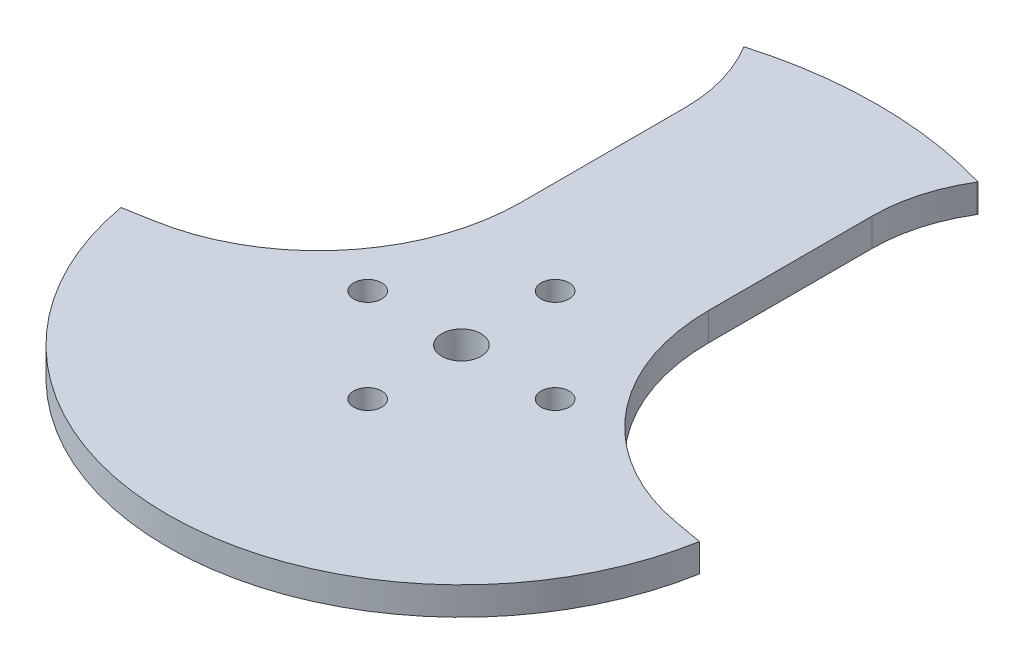
ISO-10303-21;
HEADER;
FILE_DESCRIPTION(('STEP AP214'),'2;1');
FILE_NAME('part.step','',(''),(''),'','','');
FILE_SCHEMA(('AUTOMOTIVE_DESIGN { 1 0 10303 214 1 1 1 1 }'));
ENDSEC;
DATA;
#1=APPLICATION_CONTEXT('core data for automotive mechanical design processes');
#2=APPLICATION_PROTOCOL_DEFINITION('international standard','automotive_design',2000,#1);
#3=PRODUCT_CONTEXT('',#1,'mechanical');
#4=PRODUCT('Part','Part','',(#3));
#5=PRODUCT_RELATED_PRODUCT_CATEGORY('part','',(#4));
#6=PRODUCT_DEFINITION_FORMATION('','',#4);
#7=PRODUCT_DEFINITION_CONTEXT('part definition',#1,'design');
#8=PRODUCT_DEFINITION('design','',#6,#7);
#9=PRODUCT_DEFINITION_SHAPE('','',#8);
#10=(LENGTH_UNIT() NAMED_UNIT(*) SI_UNIT(.MILLI.,.METRE.));
#11=(NAMED_UNIT(*) PLANE_ANGLE_UNIT() SI_UNIT($,.RADIAN.));
#12=(NAMED_UNIT(*) SI_UNIT($,.STERADIAN.) SOLID_ANGLE_UNIT());
#13=UNCERTAINTY_MEASURE_WITH_UNIT(LENGTH_MEASURE(1.E-05),#10,'distance_accuracy_value','');
#14=(GEOMETRIC_REPRESENTATION_CONTEXT(3) GLOBAL_UNCERTAINTY_ASSIGNED_CONTEXT((#13)) GLOBAL_UNIT_ASSIGNED_CONTEXT((#10,
#11,#12)) REPRESENTATION_CONTEXT('',''));
#15=CARTESIAN_POINT('',(0.,0.,0.));
#16=DIRECTION('',(0.,0.,1.));
#17=DIRECTION('',(1.,0.,0.));
#18=AXIS2_PLACEMENT_3D('',#15,#16,#17);
#19=CARTESIAN_POINT('',(0.,3.,1.73472347597681E-13));
#20=DIRECTION('',(0.,-1.,0.));
#21=DIRECTION('',(0.,0.,-1.));
#22=AXIS2_PLACEMENT_3D('',#19,#20,#21);
#23=CYLINDRICAL_SURFACE('',#22,44.4500000000002);
#24=CARTESIAN_POINT('',(0.,0.,1.73472347597681E-13));
#25=DIRECTION('',(0.,1.,0.));
#26=DIRECTION('',(0.,0.,-1.));
#27=AXIS2_PLACEMENT_3D('',#24,#25,#26);
#28=CIRCLE('',#27,44.4500000000002);
#29=CARTESIAN_POINT('',(12.5,0.,-42.6562129120718));
#30=VERTEX_POINT('',#29);
#31=CARTESIAN_POINT('',(-12.5,0.,-42.6562129120718));
#32=VERTEX_POINT('',#31);
#33=EDGE_CURVE('E164',#30,#32,#28,.T.);
#34=ORIENTED_EDGE('',*,*,#33,.T.);
#35=DIRECTION('',(0.,-1.,0.));
#36=VECTOR('',#35,1.);
#37=CARTESIAN_POINT('',(-12.5,3.,-42.6562129120718));
#38=LINE('',#37,#36);
#39=CARTESIAN_POINT('',(-12.5,3.,-42.6562129120718));
#40=VERTEX_POINT('',#39);
#41=EDGE_CURVE('E11',#40,#32,#38,.T.);
#42=ORIENTED_EDGE('',*,*,#41,.F.);
#43=CARTESIAN_POINT('',(0.,3.,1.73472347597681E-13));
#44=DIRECTION('',(0.,1.,0.));
#45=DIRECTION('',(0.,0.,-1.));
#46=AXIS2_PLACEMENT_3D('',#43,#44,#45);
#47=CIRCLE('',#46,44.4500000000002);
#48=CARTESIAN_POINT('',(12.5,3.,-42.6562129120718));
#49=VERTEX_POINT('',#48);
#50=EDGE_CURVE('E199',#49,#40,#47,.T.);
#51=ORIENTED_EDGE('',*,*,#50,.F.);
#52=DIRECTION('',(0.,-1.,0.));
#53=VECTOR('',#52,1.);
#54=CARTESIAN_POINT('',(12.5,3.,-42.6562129120718));
#55=LINE('',#54,#53);
#56=EDGE_CURVE('E160',#49,#30,#55,.T.);
#57=ORIENTED_EDGE('',*,*,#56,.T.);
#58=EDGE_LOOP('',(#34,#42,#51,#57));
#59=FACE_BOUND('',#58,.T.);
#60=ADVANCED_FACE('F39',(#59),#23,.T.);
#61=CARTESIAN_POINT('',(-12.5,3.,-42.6562129120718));
#62=DIRECTION('',(0.854161971646219,0.,-0.520007044369058));
#63=DIRECTION('',(-0.520007044369058,0.,-0.854161971646219));
#64=AXIS2_PLACEMENT_3D('',#61,#62,#63);
#65=PLANE('',#64);
#66=DIRECTION('',(0.520007044369058,0.,0.854161971646219));
#67=VECTOR('',#66,1.);
#68=CARTESIAN_POINT('',(-12.5,0.,-42.6562129120718));
#69=LINE('',#68,#67);
#70=CARTESIAN_POINT('',(-12.4479992955631,0.,-42.5707967149072));
#71=VERTEX_POINT('',#70);
#72=EDGE_CURVE('E168',#32,#71,#69,.T.);
#73=ORIENTED_EDGE('',*,*,#72,.T.);
#74=DIRECTION('',(0.,-1.,0.));
#75=VECTOR('',#74,1.);
#76=CARTESIAN_POINT('',(-12.4479992955631,3.,-42.5707967149072));
#77=LINE('',#76,#75);
#78=CARTESIAN_POINT('',(-12.4479992955631,3.,-42.5707967149072));
#79=VERTEX_POINT('',#78);
#80=EDGE_CURVE('E48',#79,#71,#77,.T.);
#81=ORIENTED_EDGE('',*,*,#80,.F.);
#82=DIRECTION('',(0.520007044369058,0.,0.854161971646219));
#83=VECTOR('',#82,1.);
#84=CARTESIAN_POINT('',(-12.5,3.,-42.6562129120718));
#85=LINE('',#84,#83);
#86=EDGE_CURVE('E111',#40,#79,#85,.T.);
#87=ORIENTED_EDGE('',*,*,#86,.F.);
#88=ORIENTED_EDGE('',*,*,#41,.T.);
#89=EDGE_LOOP('',(#73,#81,#87,#88));
#90=FACE_BOUND('',#89,.T.);
#91=ADVANCED_FACE('F294',(#90),#65,.F.);
#92=CARTESIAN_POINT('',(-26.7857404765812,3.,-33.8420934221337));
#93=DIRECTION('',(0.,-1.,0.));
#94=DIRECTION('',(0.,0.,-1.));
#95=AXIS2_PLACEMENT_3D('',#92,#93,#94);
#96=CYLINDRICAL_SURFACE('',#95,16.7857404765812);
#97=CARTESIAN_POINT('',(-26.7857404765812,0.,-33.8420934221337));
#98=DIRECTION('',(0.,-1.,0.));
#99=DIRECTION('',(0.,0.,-1.));
#100=AXIS2_PLACEMENT_3D('',#97,#98,#99);
#101=CIRCLE('',#100,16.7857404765812);
#102=CARTESIAN_POINT('',(-10.,0.,-33.8420934221337));
#103=VERTEX_POINT('',#102);
#104=EDGE_CURVE('E172',#71,#103,#101,.T.);
#105=ORIENTED_EDGE('',*,*,#104,.T.);
#106=DIRECTION('',(0.,-1.,0.));
#107=VECTOR('',#106,1.);
#108=CARTESIAN_POINT('',(-10.,3.,-33.8420934221337));
#109=LINE('',#108,#107);
#110=CARTESIAN_POINT('',(-10.,3.,-33.8420934221337));
#111=VERTEX_POINT('',#110);
#112=EDGE_CURVE('E226',#111,#103,#109,.T.);
#113=ORIENTED_EDGE('',*,*,#112,.F.);
#114=CARTESIAN_POINT('',(-26.7857404765812,3.,-33.8420934221337));
#115=DIRECTION('',(0.,-1.,0.));
#116=DIRECTION('',(0.,0.,-1.));
#117=AXIS2_PLACEMENT_3D('',#114,#115,#116);
#118=CIRCLE('',#117,16.7857404765812);
#119=EDGE_CURVE('E236',#79,#111,#118,.T.);
#120=ORIENTED_EDGE('',*,*,#119,.F.);
#121=ORIENTED_EDGE('',*,*,#80,.T.);
#122=EDGE_LOOP('',(#105,#113,#120,#121));
#123=FACE_BOUND('',#122,.T.);
#124=ADVANCED_FACE('F234',(#123),#96,.F.);
#125=CARTESIAN_POINT('',(-10.,3.,-33.8420934221337));
#126=DIRECTION('',(1.,0.,0.));
#127=DIRECTION('',(0.,0.,-1.));
#128=AXIS2_PLACEMENT_3D('',#125,#126,#127);
#129=PLANE('',#128);
#130=DIRECTION('',(0.,0.,1.));
#131=VECTOR('',#130,1.);
#132=CARTESIAN_POINT('',(-10.,0.,-33.8420934221337));
#133=LINE('',#132,#131);
#134=CARTESIAN_POINT('',(-9.99999999999999,0.,-16.4089854674819));
#135=VERTEX_POINT('',#134);
#136=EDGE_CURVE('E175',#103,#135,#133,.T.);
#137=ORIENTED_EDGE('',*,*,#136,.T.);
#138=DIRECTION('',(0.,-1.,0.));
#139=VECTOR('',#138,1.);
#140=CARTESIAN_POINT('',(-9.99999999999999,3.,-16.4089854674819));
#141=LINE('',#140,#139);
#142=CARTESIAN_POINT('',(-9.99999999999999,3.,-16.4089854674819));
#143=VERTEX_POINT('',#142);
#144=EDGE_CURVE('E222',#143,#135,#141,.T.);
#145=ORIENTED_EDGE('',*,*,#144,.F.);
#146=DIRECTION('',(0.,0.,1.));
#147=VECTOR('',#146,1.);
#148=CARTESIAN_POINT('',(-10.,3.,-33.8420934221337));
#149=LINE('',#148,#147);
#150=EDGE_CURVE('E255',#111,#143,#149,.T.);
#151=ORIENTED_EDGE('',*,*,#150,.F.);
#152=ORIENTED_EDGE('',*,*,#112,.T.);
#153=EDGE_LOOP('',(#137,#145,#151,#152));
#154=FACE_BOUND('',#153,.T.);
#155=ADVANCED_FACE('F245',(#154),#129,.F.);
#156=CARTESIAN_POINT('',(-31.6568505090039,3.,-16.4089854674819));
#157=DIRECTION('',(0.,-1.,0.));
#158=DIRECTION('',(0.,0.,-1.));
#159=AXIS2_PLACEMENT_3D('',#156,#157,#158);
#160=CYLINDRICAL_SURFACE('',#159,21.6568505090039);
#161=CARTESIAN_POINT('',(-31.6568505090039,0.,-16.4089854674819));
#162=DIRECTION('',(0.,-1.,0.));
#163=DIRECTION('',(0.,0.,-1.));
#164=AXIS2_PLACEMENT_3D('',#161,#162,#163);
#165=CIRCLE('',#164,21.6568505090039);
#166=CARTESIAN_POINT('',(-27.8961778841101,0.,4.91884881961152));
#167=VERTEX_POINT('',#166);
#168=EDGE_CURVE('E178',#135,#167,#165,.T.);
#169=ORIENTED_EDGE('',*,*,#168,.T.);
#170=DIRECTION('',(0.,-1.,0.));
#171=VECTOR('',#170,1.);
#172=CARTESIAN_POINT('',(-27.8961778841101,3.,4.91884881961152));
#173=LINE('',#172,#171);
#174=CARTESIAN_POINT('',(-27.8961778841101,3.,4.91884881961152));
#175=VERTEX_POINT('',#174);
#176=EDGE_CURVE('E218',#175,#167,#173,.T.);
#177=ORIENTED_EDGE('',*,*,#176,.F.);
#178=CARTESIAN_POINT('',(-31.6568505090039,3.,-16.4089854674819));
#179=DIRECTION('',(0.,-1.,0.));
#180=DIRECTION('',(0.,0.,-1.));
#181=AXIS2_PLACEMENT_3D('',#178,#179,#180);
#182=CIRCLE('',#181,21.6568505090039);
#183=EDGE_CURVE('E251',#143,#175,#182,.T.);
#184=ORIENTED_EDGE('',*,*,#183,.F.);
#185=ORIENTED_EDGE('',*,*,#144,.T.);
#186=EDGE_LOOP('',(#169,#177,#184,#185));
#187=FACE_BOUND('',#186,.T.);
#188=ADVANCED_FACE('F249',(#187),#160,.F.);
#189=CARTESIAN_POINT('',(-27.8961778841101,3.,4.91884881961152));
#190=DIRECTION('',(0.173648177666934,0.,0.984807753012207));
#191=DIRECTION('',(0.984807753012208,0.,-0.173648177666934));
#192=AXIS2_PLACEMENT_3D('',#189,#190,#191);
#193=PLANE('',#192);
#194=DIRECTION('',(-0.984807753012207,0.,0.173648177666934));
#195=VECTOR('',#194,1.);
#196=CARTESIAN_POINT('',(-27.8961778841101,0.,4.91884881961152));
#197=LINE('',#196,#195);
#198=CARTESIAN_POINT('',(-30.8737230569327,0.,5.4438703698584));
#199=VERTEX_POINT('',#198);
#200=EDGE_CURVE('E181',#167,#199,#197,.T.);
#201=ORIENTED_EDGE('',*,*,#200,.T.);
#202=DIRECTION('',(0.,-1.,0.));
#203=VECTOR('',#202,1.);
#204=CARTESIAN_POINT('',(-30.8737230569327,3.,5.4438703698584));
#205=LINE('',#204,#203);
#206=CARTESIAN_POINT('',(-30.8737230569327,3.,5.4438703698584));
#207=VERTEX_POINT('',#206);
#208=EDGE_CURVE('E214',#207,#199,#205,.T.);
#209=ORIENTED_EDGE('',*,*,#208,.F.);
#210=DIRECTION('',(-0.984807753012207,0.,0.173648177666934));
#211=VECTOR('',#210,1.);
#212=CARTESIAN_POINT('',(-27.8961778841101,3.,4.91884881961152));
#213=LINE('',#212,#211);
#214=EDGE_CURVE('E254',#175,#207,#213,.T.);
#215=ORIENTED_EDGE('',*,*,#214,.F.);
#216=ORIENTED_EDGE('',*,*,#176,.T.);
#217=EDGE_LOOP('',(#201,#209,#215,#216));
#218=FACE_BOUND('',#217,.T.);
#219=ADVANCED_FACE('F307',(#218),#193,.F.);
#220=CARTESIAN_POINT('',(0.,3.,0.));
#221=DIRECTION('',(0.,-1.,0.));
#222=DIRECTION('',(0.,0.,-1.));
#223=AXIS2_PLACEMENT_3D('',#220,#221,#222);
#224=CYLINDRICAL_SURFACE('',#223,31.35);
#225=CARTESIAN_POINT('',(0.,0.,0.));
#226=DIRECTION('',(0.,1.,0.));
#227=DIRECTION('',(0.,0.,1.));
#228=AXIS2_PLACEMENT_3D('',#225,#226,#227);
#229=CIRCLE('',#228,31.35);
#230=CARTESIAN_POINT('',(30.8737230569327,0.,5.4438703698584));
#231=VERTEX_POINT('',#230);
#232=EDGE_CURVE('E184',#199,#231,#229,.T.);
#233=ORIENTED_EDGE('',*,*,#232,.T.);
#234=DIRECTION('',(0.,-1.,0.));
#235=VECTOR('',#234,1.);
#236=CARTESIAN_POINT('',(30.8737230569327,3.,5.4438703698584));
#237=LINE('',#236,#235);
#238=CARTESIAN_POINT('',(30.8737230569327,3.,5.4438703698584));
#239=VERTEX_POINT('',#238);
#240=EDGE_CURVE('E210',#239,#231,#237,.T.);
#241=ORIENTED_EDGE('',*,*,#240,.F.);
#242=CARTESIAN_POINT('',(0.,3.,0.));
#243=DIRECTION('',(0.,1.,0.));
#244=DIRECTION('',(0.,0.,1.));
#245=AXIS2_PLACEMENT_3D('',#242,#243,#244);
#246=CIRCLE('',#245,31.35);
#247=EDGE_CURVE('E259',#207,#239,#246,.T.);
#248=ORIENTED_EDGE('',*,*,#247,.F.);
#249=ORIENTED_EDGE('',*,*,#208,.T.);
#250=EDGE_LOOP('',(#233,#241,#248,#249));
#251=FACE_BOUND('',#250,.T.);
#252=ADVANCED_FACE('F310',(#251),#224,.T.);
#253=CARTESIAN_POINT('',(27.8961778841101,3.,4.91884881961152));
#254=DIRECTION('',(-0.173648177666935,0.,0.984807753012207));
#255=DIRECTION('',(0.984807753012207,0.,0.173648177666935));
#256=AXIS2_PLACEMENT_3D('',#253,#254,#255);
#257=PLANE('',#256);
#258=DIRECTION('',(-0.984807753012207,0.,-0.173648177666935));
#259=VECTOR('',#258,1.);
#260=CARTESIAN_POINT('',(27.8961778841101,0.,4.91884881961152));
#261=LINE('',#260,#259);
#262=CARTESIAN_POINT('',(27.8961778841101,0.,4.91884881961152));
#263=VERTEX_POINT('',#262);
#264=EDGE_CURVE('E187',#231,#263,#261,.T.);
#265=ORIENTED_EDGE('',*,*,#264,.T.);
#266=DIRECTION('',(0.,-1.,0.));
#267=VECTOR('',#266,1.);
#268=CARTESIAN_POINT('',(27.8961778841101,3.,4.91884881961152));
#269=LINE('',#268,#267);
#270=CARTESIAN_POINT('',(27.8961778841101,3.,4.91884881961152));
#271=VERTEX_POINT('',#270);
#272=EDGE_CURVE('E206',#271,#263,#269,.T.);
#273=ORIENTED_EDGE('',*,*,#272,.F.);
#274=DIRECTION('',(-0.984807753012207,0.,-0.173648177666935));
#275=VECTOR('',#274,1.);
#276=CARTESIAN_POINT('',(27.8961778841101,3.,4.91884881961152));
#277=LINE('',#276,#275);
#278=EDGE_CURVE('E266',#239,#271,#277,.T.);
#279=ORIENTED_EDGE('',*,*,#278,.F.);
#280=ORIENTED_EDGE('',*,*,#240,.T.);
#281=EDGE_LOOP('',(#265,#273,#279,#280));
#282=FACE_BOUND('',#281,.T.);
#283=ADVANCED_FACE('F274',(#282),#257,.F.);
#284=CARTESIAN_POINT('',(31.6568505090039,3.,-16.4089854674819));
#285=DIRECTION('',(0.,-1.,0.));
#286=DIRECTION('',(0.,0.,-1.));
#287=AXIS2_PLACEMENT_3D('',#284,#285,#286);
#288=CYLINDRICAL_SURFACE('',#287,21.6568505090039);
#289=CARTESIAN_POINT('',(31.6568505090039,0.,-16.4089854674819));
#290=DIRECTION('',(0.,-1.,0.));
#291=DIRECTION('',(0.,0.,1.));
#292=AXIS2_PLACEMENT_3D('',#289,#290,#291);
#293=CIRCLE('',#292,21.6568505090039);
#294=CARTESIAN_POINT('',(9.99999999999999,0.,-16.4089854674819));
#295=VERTEX_POINT('',#294);
#296=EDGE_CURVE('E190',#263,#295,#293,.T.);
#297=ORIENTED_EDGE('',*,*,#296,.T.);
#298=DIRECTION('',(0.,-1.,0.));
#299=VECTOR('',#298,1.);
#300=CARTESIAN_POINT('',(9.99999999999999,3.,-16.4089854674819));
#301=LINE('',#300,#299);
#302=CARTESIAN_POINT('',(9.99999999999999,3.,-16.4089854674819));
#303=VERTEX_POINT('',#302);
#304=EDGE_CURVE('E153',#303,#295,#301,.T.);
#305=ORIENTED_EDGE('',*,*,#304,.F.);
#306=CARTESIAN_POINT('',(31.6568505090039,3.,-16.4089854674819));
#307=DIRECTION('',(0.,-1.,0.));
#308=DIRECTION('',(0.,0.,1.));
#309=AXIS2_PLACEMENT_3D('',#306,#307,#308);
#310=CIRCLE('',#309,21.6568505090039);
#311=EDGE_CURVE('E142',#271,#303,#310,.T.);
#312=ORIENTED_EDGE('',*,*,#311,.F.);
#313=ORIENTED_EDGE('',*,*,#272,.T.);
#314=EDGE_LOOP('',(#297,#305,#312,#313));
#315=FACE_BOUND('',#314,.T.);
#316=ADVANCED_FACE('F278',(#315),#288,.F.);
#317=CARTESIAN_POINT('',(10.,3.,-33.8420934221337));
#318=DIRECTION('',(-1.,0.,0.));
#319=DIRECTION('',(0.,0.,1.));
#320=AXIS2_PLACEMENT_3D('',#317,#318,#319);
#321=PLANE('',#320);
#322=DIRECTION('',(0.,0.,-1.));
#323=VECTOR('',#322,1.);
#324=CARTESIAN_POINT('',(10.,0.,-33.8420934221337));
#325=LINE('',#324,#323);
#326=CARTESIAN_POINT('',(10.,0.,-33.8420934221337));
#327=VERTEX_POINT('',#326);
#328=EDGE_CURVE('E151',#295,#327,#325,.T.);
#329=ORIENTED_EDGE('',*,*,#328,.T.);
#330=DIRECTION('',(0.,-1.,0.));
#331=VECTOR('',#330,1.);
#332=CARTESIAN_POINT('',(10.,3.,-33.8420934221337));
#333=LINE('',#332,#331);
#334=CARTESIAN_POINT('',(10.,3.,-33.8420934221337));
#335=VERTEX_POINT('',#334);
#336=EDGE_CURVE('E148',#335,#327,#333,.T.);
#337=ORIENTED_EDGE('',*,*,#336,.F.);
#338=DIRECTION('',(0.,0.,-1.));
#339=VECTOR('',#338,1.);
#340=CARTESIAN_POINT('',(10.,3.,-33.8420934221337));
#341=LINE('',#340,#339);
#342=EDGE_CURVE('E136',#303,#335,#341,.T.);
#343=ORIENTED_EDGE('',*,*,#342,.F.);
#344=ORIENTED_EDGE('',*,*,#304,.T.);
#345=EDGE_LOOP('',(#329,#337,#343,#344));
#346=FACE_BOUND('',#345,.T.);
#347=ADVANCED_FACE('F149',(#346),#321,.F.);
#348=CARTESIAN_POINT('',(26.7857404765812,3.,-33.8420934221337));
#349=DIRECTION('',(0.,-1.,0.));
#350=DIRECTION('',(0.,0.,-1.));
#351=AXIS2_PLACEMENT_3D('',#348,#349,#350);
#352=CYLINDRICAL_SURFACE('',#351,16.7857404765812);
#353=CARTESIAN_POINT('',(26.7857404765812,0.,-33.8420934221337));
#354=DIRECTION('',(0.,-1.,0.));
#355=DIRECTION('',(0.,0.,1.));
#356=AXIS2_PLACEMENT_3D('',#353,#354,#355);
#357=CIRCLE('',#356,16.7857404765812);
#358=CARTESIAN_POINT('',(12.4479992955631,0.,-42.5707967149072));
#359=VERTEX_POINT('',#358);
#360=EDGE_CURVE('E97',#327,#359,#357,.T.);
#361=ORIENTED_EDGE('',*,*,#360,.T.);
#362=DIRECTION('',(0.,-1.,0.));
#363=VECTOR('',#362,1.);
#364=CARTESIAN_POINT('',(12.4479992955631,3.,-42.5707967149072));
#365=LINE('',#364,#363);
#366=CARTESIAN_POINT('',(12.4479992955631,3.,-42.5707967149072));
#367=VERTEX_POINT('',#366);
#368=EDGE_CURVE('E154',#367,#359,#365,.T.);
#369=ORIENTED_EDGE('',*,*,#368,.F.);
#370=CARTESIAN_POINT('',(26.7857404765812,3.,-33.8420934221337));
#371=DIRECTION('',(0.,-1.,0.));
#372=DIRECTION('',(0.,0.,1.));
#373=AXIS2_PLACEMENT_3D('',#370,#371,#372);
#374=CIRCLE('',#373,16.7857404765812);
#375=EDGE_CURVE('E140',#335,#367,#374,.T.);
#376=ORIENTED_EDGE('',*,*,#375,.F.);
#377=ORIENTED_EDGE('',*,*,#336,.T.);
#378=EDGE_LOOP('',(#361,#369,#376,#377));
#379=FACE_BOUND('',#378,.T.);
#380=ADVANCED_FACE('F156',(#379),#352,.F.);
#381=CARTESIAN_POINT('',(12.5,3.,-42.6562129120718));
#382=DIRECTION('',(-0.854161971646188,0.,-0.520007044369109));
#383=DIRECTION('',(-0.520007044369109,0.,0.854161971646188));
#384=AXIS2_PLACEMENT_3D('',#381,#382,#383);
#385=PLANE('',#384);
#386=DIRECTION('',(0.520007044369109,0.,-0.854161971646188));
#387=VECTOR('',#386,1.);
#388=CARTESIAN_POINT('',(12.5,0.,-42.6562129120718));
#389=LINE('',#388,#387);
#390=EDGE_CURVE('E103',#359,#30,#389,.T.);
#391=ORIENTED_EDGE('',*,*,#390,.T.);
#392=ORIENTED_EDGE('',*,*,#56,.F.);
#393=DIRECTION('',(0.520007044369109,0.,-0.854161971646188));
#394=VECTOR('',#393,1.);
#395=CARTESIAN_POINT('',(12.5,3.,-42.6562129120718));
#396=LINE('',#395,#394);
#397=EDGE_CURVE('E56',#367,#49,#396,.T.);
#398=ORIENTED_EDGE('',*,*,#397,.F.);
#399=ORIENTED_EDGE('',*,*,#368,.T.);
#400=EDGE_LOOP('',(#391,#392,#398,#399));
#401=FACE_BOUND('',#400,.T.);
#402=ADVANCED_FACE('F282',(#401),#385,.F.);
#403=CARTESIAN_POINT('',(0.,3.,1.73472347597681E-13));
#404=DIRECTION('',(0.,-1.,0.));
#405=DIRECTION('',(0.,0.,-1.));
#406=AXIS2_PLACEMENT_3D('',#403,#404,#405);
#407=PLANE('',#406);
#408=CARTESIAN_POINT('',(10.,3.,-0.0140875505962867));
#409=DIRECTION('',(0.,1.,0.));
#410=DIRECTION('',(0.,0.,1.));
#411=AXIS2_PLACEMENT_3D('',#408,#409,#410);
#412=CIRCLE('',#411,1.5);
#413=CARTESIAN_POINT('',(10.,3.,1.48591244940371));
#414=VERTEX_POINT('',#413);
#415=EDGE_CURVE('E406',#414,#414,#412,.T.);
#416=ORIENTED_EDGE('',*,*,#415,.F.);
#417=EDGE_LOOP('',(#416));
#418=FACE_BOUND('',#417,.T.);
#419=CARTESIAN_POINT('',(0.,3.,-10.0140875505963));
#420=DIRECTION('',(0.,1.,0.));
#421=DIRECTION('',(0.,0.,1.));
#422=AXIS2_PLACEMENT_3D('',#419,#420,#421);
#423=CIRCLE('',#422,1.5);
#424=CARTESIAN_POINT('',(0.,3.,-8.51408755059629));
#425=VERTEX_POINT('',#424);
#426=EDGE_CURVE('E415',#425,#425,#423,.T.);
#427=ORIENTED_EDGE('',*,*,#426,.F.);
#428=EDGE_LOOP('',(#427));
#429=FACE_BOUND('',#428,.T.);
#430=CARTESIAN_POINT('',(-10.,3.,-0.0140875505962867));
#431=DIRECTION('',(0.,1.,0.));
#432=DIRECTION('',(0.,0.,1.));
#433=AXIS2_PLACEMENT_3D('',#430,#431,#432);
#434=CIRCLE('',#433,1.5);
#435=CARTESIAN_POINT('',(-10.,3.,1.48591244940371));
#436=VERTEX_POINT('',#435);
#437=EDGE_CURVE('E442',#436,#436,#434,.T.);
#438=ORIENTED_EDGE('',*,*,#437,.F.);
#439=EDGE_LOOP('',(#438));
#440=FACE_BOUND('',#439,.T.);
#441=CARTESIAN_POINT('',(0.,3.,9.98591244940371));
#442=DIRECTION('',(0.,1.,0.));
#443=DIRECTION('',(0.,0.,1.));
#444=AXIS2_PLACEMENT_3D('',#441,#442,#443);
#445=CIRCLE('',#444,1.5);
#446=CARTESIAN_POINT('',(0.,3.,11.4859124494037));
#447=VERTEX_POINT('',#446);
#448=EDGE_CURVE('E453',#447,#447,#445,.T.);
#449=ORIENTED_EDGE('',*,*,#448,.F.);
#450=EDGE_LOOP('',(#449));
#451=FACE_BOUND('',#450,.T.);
#452=CARTESIAN_POINT('',(0.,3.,-0.0140875505962867));
#453=DIRECTION('',(0.,1.,0.));
#454=DIRECTION('',(0.,0.,1.));
#455=AXIS2_PLACEMENT_3D('',#452,#453,#454);
#456=CIRCLE('',#455,2.1);
#457=CARTESIAN_POINT('',(0.,3.,2.08591244940371));
#458=VERTEX_POINT('',#457);
#459=EDGE_CURVE('E412',#458,#458,#456,.T.);
#460=ORIENTED_EDGE('',*,*,#459,.F.);
#461=EDGE_LOOP('',(#460));
#462=FACE_BOUND('',#461,.T.);
#463=ORIENTED_EDGE('',*,*,#50,.T.);
#464=ORIENTED_EDGE('',*,*,#86,.T.);
#465=ORIENTED_EDGE('',*,*,#119,.T.);
#466=ORIENTED_EDGE('',*,*,#150,.T.);
#467=ORIENTED_EDGE('',*,*,#183,.T.);
#468=ORIENTED_EDGE('',*,*,#214,.T.);
#469=ORIENTED_EDGE('',*,*,#247,.T.);
#470=ORIENTED_EDGE('',*,*,#278,.T.);
#471=ORIENTED_EDGE('',*,*,#311,.T.);
#472=ORIENTED_EDGE('',*,*,#342,.T.);
#473=ORIENTED_EDGE('',*,*,#375,.T.);
#474=ORIENTED_EDGE('',*,*,#397,.T.);
#475=EDGE_LOOP('',(#463,#464,#465,#466,#467,#468,#469,#470,#471,#472,#473,#474));
#476=FACE_BOUND('',#475,.T.);
#477=ADVANCED_FACE('F138',(#418,#429,#440,#451,#462,#476),#407,.F.);
#478=CARTESIAN_POINT('',(0.,0.,1.73472347597681E-13));
#479=DIRECTION('',(0.,-1.,0.));
#480=DIRECTION('',(0.,0.,-1.));
#481=AXIS2_PLACEMENT_3D('',#478,#479,#480);
#482=PLANE('',#481);
#483=CARTESIAN_POINT('',(10.,0.,-0.0140875505962867));
#484=DIRECTION('',(0.,1.,0.));
#485=DIRECTION('',(0.,0.,1.));
#486=AXIS2_PLACEMENT_3D('',#483,#484,#485);
#487=CIRCLE('',#486,1.5);
#488=CARTESIAN_POINT('',(10.,0.,1.48591244940371));
#489=VERTEX_POINT('',#488);
#490=EDGE_CURVE('E403',#489,#489,#487,.T.);
#491=ORIENTED_EDGE('',*,*,#490,.T.);
#492=EDGE_LOOP('',(#491));
#493=FACE_BOUND('',#492,.T.);
#494=CARTESIAN_POINT('',(0.,0.,-10.0140875505963));
#495=DIRECTION('',(0.,1.,0.));
#496=DIRECTION('',(0.,0.,1.));
#497=AXIS2_PLACEMENT_3D('',#494,#495,#496);
#498=CIRCLE('',#497,1.5);
#499=CARTESIAN_POINT('',(0.,0.,-8.51408755059629));
#500=VERTEX_POINT('',#499);
#501=EDGE_CURVE('E408',#500,#500,#498,.T.);
#502=ORIENTED_EDGE('',*,*,#501,.T.);
#503=EDGE_LOOP('',(#502));
#504=FACE_BOUND('',#503,.T.);
#505=CARTESIAN_POINT('',(-10.,0.,-0.0140875505962867));
#506=DIRECTION('',(0.,1.,0.));
#507=DIRECTION('',(0.,0.,1.));
#508=AXIS2_PLACEMENT_3D('',#505,#506,#507);
#509=CIRCLE('',#508,1.5);
#510=CARTESIAN_POINT('',(-10.,0.,1.48591244940371));
#511=VERTEX_POINT('',#510);
#512=EDGE_CURVE('E422',#511,#511,#509,.T.);
#513=ORIENTED_EDGE('',*,*,#512,.T.);
#514=EDGE_LOOP('',(#513));
#515=FACE_BOUND('',#514,.T.);
#516=CARTESIAN_POINT('',(0.,0.,9.98591244940371));
#517=DIRECTION('',(0.,1.,0.));
#518=DIRECTION('',(0.,0.,1.));
#519=AXIS2_PLACEMENT_3D('',#516,#517,#518);
#520=CIRCLE('',#519,1.5);
#521=CARTESIAN_POINT('',(0.,0.,11.4859124494037));
#522=VERTEX_POINT('',#521);
#523=EDGE_CURVE('E448',#522,#522,#520,.T.);
#524=ORIENTED_EDGE('',*,*,#523,.T.);
#525=EDGE_LOOP('',(#524));
#526=FACE_BOUND('',#525,.T.);
#527=CARTESIAN_POINT('',(0.,0.,-0.0140875505962867));
#528=DIRECTION('',(0.,1.,0.));
#529=DIRECTION('',(0.,0.,1.));
#530=AXIS2_PLACEMENT_3D('',#527,#528,#529);
#531=CIRCLE('',#530,2.1);
#532=CARTESIAN_POINT('',(0.,0.,2.08591244940371));
#533=VERTEX_POINT('',#532);
#534=EDGE_CURVE('E169',#533,#533,#531,.T.);
#535=ORIENTED_EDGE('',*,*,#534,.T.);
#536=EDGE_LOOP('',(#535));
#537=FACE_BOUND('',#536,.T.);
#538=ORIENTED_EDGE('',*,*,#33,.F.);
#539=ORIENTED_EDGE('',*,*,#390,.F.);
#540=ORIENTED_EDGE('',*,*,#360,.F.);
#541=ORIENTED_EDGE('',*,*,#328,.F.);
#542=ORIENTED_EDGE('',*,*,#296,.F.);
#543=ORIENTED_EDGE('',*,*,#264,.F.);
#544=ORIENTED_EDGE('',*,*,#232,.F.);
#545=ORIENTED_EDGE('',*,*,#200,.F.);
#546=ORIENTED_EDGE('',*,*,#168,.F.);
#547=ORIENTED_EDGE('',*,*,#136,.F.);
#548=ORIENTED_EDGE('',*,*,#104,.F.);
#549=ORIENTED_EDGE('',*,*,#72,.F.);
#550=EDGE_LOOP('',(#538,#539,#540,#541,#542,#543,#544,#545,#546,#547,#548,#549));
#551=FACE_BOUND('',#550,.T.);
#552=ADVANCED_FACE('F240',(#493,#504,#515,#526,#537,#551),#482,.T.);
#553=CARTESIAN_POINT('',(0.,0.,-0.0140875505962867));
#554=DIRECTION('',(0.,1.,0.));
#555=DIRECTION('',(0.,0.,1.));
#556=AXIS2_PLACEMENT_3D('',#553,#554,#555);
#557=CYLINDRICAL_SURFACE('',#556,2.1);
#558=ORIENTED_EDGE('',*,*,#534,.F.);
#559=EDGE_LOOP('',(#558));
#560=FACE_BOUND('',#559,.T.);
#561=ORIENTED_EDGE('',*,*,#459,.T.);
#562=EDGE_LOOP('',(#561));
#563=FACE_BOUND('',#562,.T.);
#564=ADVANCED_FACE('F347',(#560,#563),#557,.F.);
#565=CARTESIAN_POINT('',(0.,0.,9.98591244940371));
#566=DIRECTION('',(0.,1.,0.));
#567=DIRECTION('',(0.,0.,1.));
#568=AXIS2_PLACEMENT_3D('',#565,#566,#567);
#569=CYLINDRICAL_SURFACE('',#568,1.5);
#570=ORIENTED_EDGE('',*,*,#523,.F.);
#571=EDGE_LOOP('',(#570));
#572=FACE_BOUND('',#571,.T.);
#573=ORIENTED_EDGE('',*,*,#448,.T.);
#574=EDGE_LOOP('',(#573));
#575=FACE_BOUND('',#574,.T.);
#576=ADVANCED_FACE('F356',(#572,#575),#569,.F.);
#577=CARTESIAN_POINT('',(-10.,0.,-0.0140875505962867));
#578=DIRECTION('',(0.,1.,0.));
#579=DIRECTION('',(0.,0.,1.));
#580=AXIS2_PLACEMENT_3D('',#577,#578,#579);
#581=CYLINDRICAL_SURFACE('',#580,1.5);
#582=ORIENTED_EDGE('',*,*,#512,.F.);
#583=EDGE_LOOP('',(#582));
#584=FACE_BOUND('',#583,.T.);
#585=ORIENTED_EDGE('',*,*,#437,.T.);
#586=EDGE_LOOP('',(#585));
#587=FACE_BOUND('',#586,.T.);
#588=ADVANCED_FACE('F366',(#584,#587),#581,.F.);
#589=CARTESIAN_POINT('',(0.,0.,-10.0140875505963));
#590=DIRECTION('',(0.,1.,0.));
#591=DIRECTION('',(0.,0.,1.));
#592=AXIS2_PLACEMENT_3D('',#589,#590,#591);
#593=CYLINDRICAL_SURFACE('',#592,1.5);
#594=ORIENTED_EDGE('',*,*,#501,.F.);
#595=EDGE_LOOP('',(#594));
#596=FACE_BOUND('',#595,.T.);
#597=ORIENTED_EDGE('',*,*,#426,.T.);
#598=EDGE_LOOP('',(#597));
#599=FACE_BOUND('',#598,.T.);
#600=ADVANCED_FACE('F376',(#596,#599),#593,.F.);
#601=CARTESIAN_POINT('',(10.,0.,-0.0140875505962867));
#602=DIRECTION('',(0.,1.,0.));
#603=DIRECTION('',(0.,0.,1.));
#604=AXIS2_PLACEMENT_3D('',#601,#602,#603);
#605=CYLINDRICAL_SURFACE('',#604,1.5);
#606=ORIENTED_EDGE('',*,*,#490,.F.);
#607=EDGE_LOOP('',(#606));
#608=FACE_BOUND('',#607,.T.);
#609=ORIENTED_EDGE('',*,*,#415,.T.);
#610=EDGE_LOOP('',(#609));
#611=FACE_BOUND('',#610,.T.);
#612=ADVANCED_FACE('F386',(#608,#611),#605,.F.);
#613=CLOSED_SHELL('',(#60,#91,#124,#155,#188,#219,#252,#283,#316,#347,#380,#402,#477,#552,#564,
#576,#588,#600,#612));
#614=MANIFOLD_SOLID_BREP('B2',#613);
#615=ADVANCED_BREP_SHAPE_REPRESENTATION('',(#18,#614),#14);
#616=SHAPE_DEFINITION_REPRESENTATION(#9,#615);
ENDSEC;
END-ISO-10303-21;
